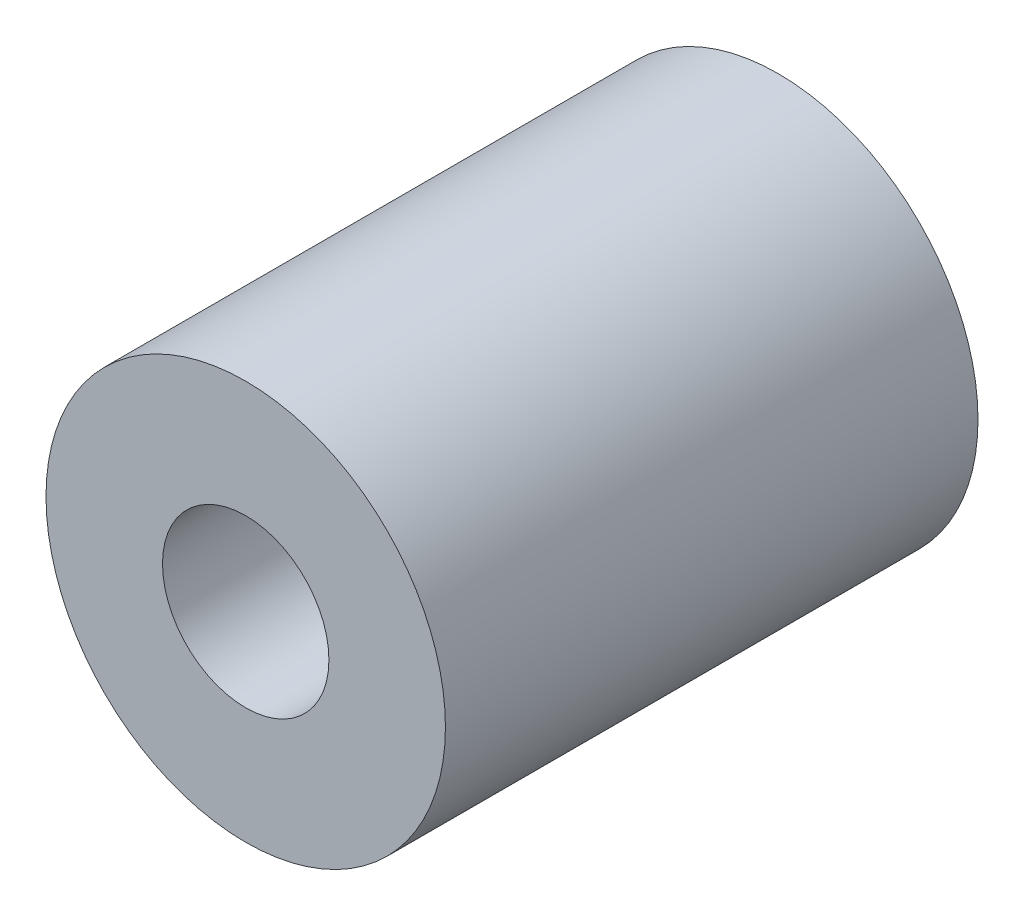
ISO-10303-21;
HEADER;
FILE_DESCRIPTION(('STEP AP214'),'2;1');
FILE_NAME('part.step','',(''),(''),'','','');
FILE_SCHEMA(('AUTOMOTIVE_DESIGN { 1 0 10303 214 1 1 1 1 }'));
ENDSEC;
DATA;
#1=APPLICATION_CONTEXT('core data for automotive mechanical design processes');
#2=APPLICATION_PROTOCOL_DEFINITION('international standard','automotive_design',2000,#1);
#3=PRODUCT_CONTEXT('',#1,'mechanical');
#4=PRODUCT('Part','Part','',(#3));
#5=PRODUCT_RELATED_PRODUCT_CATEGORY('part','',(#4));
#6=PRODUCT_DEFINITION_FORMATION('','',#4);
#7=PRODUCT_DEFINITION_CONTEXT('part definition',#1,'design');
#8=PRODUCT_DEFINITION('design','',#6,#7);
#9=PRODUCT_DEFINITION_SHAPE('','',#8);
#10=(LENGTH_UNIT() NAMED_UNIT(*) SI_UNIT(.MILLI.,.METRE.));
#11=(NAMED_UNIT(*) PLANE_ANGLE_UNIT() SI_UNIT($,.RADIAN.));
#12=(NAMED_UNIT(*) SI_UNIT($,.STERADIAN.) SOLID_ANGLE_UNIT());
#13=UNCERTAINTY_MEASURE_WITH_UNIT(LENGTH_MEASURE(1.E-05),#10,'distance_accuracy_value','');
#14=(GEOMETRIC_REPRESENTATION_CONTEXT(3) GLOBAL_UNCERTAINTY_ASSIGNED_CONTEXT((#13)) GLOBAL_UNIT_ASSIGNED_CONTEXT((#10,
#11,#12)) REPRESENTATION_CONTEXT('',''));
#15=CARTESIAN_POINT('',(0.,0.,0.));
#16=DIRECTION('',(0.,0.,1.));
#17=DIRECTION('',(1.,0.,0.));
#18=AXIS2_PLACEMENT_3D('',#15,#16,#17);
#19=CARTESIAN_POINT('',(0.,0.,-50.8));
#20=DIRECTION('',(0.,0.,1.));
#21=DIRECTION('',(1.,0.,0.));
#22=AXIS2_PLACEMENT_3D('',#19,#20,#21);
#23=CYLINDRICAL_SURFACE('',#22,19.05);
#24=CARTESIAN_POINT('',(0.,0.,-50.8));
#25=DIRECTION('',(0.,0.,1.));
#26=DIRECTION('',(1.,0.,0.));
#27=AXIS2_PLACEMENT_3D('',#24,#25,#26);
#28=CIRCLE('',#27,19.05);
#29=CARTESIAN_POINT('',(19.05,0.,-50.8));
#30=VERTEX_POINT('',#29);
#31=EDGE_CURVE('E10',#30,#30,#28,.T.);
#32=ORIENTED_EDGE('',*,*,#31,.T.);
#33=EDGE_LOOP('',(#32));
#34=FACE_BOUND('',#33,.T.);
#35=CARTESIAN_POINT('',(0.,0.,0.));
#36=DIRECTION('',(0.,0.,1.));
#37=DIRECTION('',(1.,0.,0.));
#38=AXIS2_PLACEMENT_3D('',#35,#36,#37);
#39=CIRCLE('',#38,19.05);
#40=CARTESIAN_POINT('',(19.05,0.,0.));
#41=VERTEX_POINT('',#40);
#42=EDGE_CURVE('E32',#41,#41,#39,.T.);
#43=ORIENTED_EDGE('',*,*,#42,.F.);
#44=EDGE_LOOP('',(#43));
#45=FACE_BOUND('',#44,.T.);
#46=ADVANCED_FACE('F29',(#34,#45),#23,.T.);
#47=CARTESIAN_POINT('',(0.,0.,-50.8));
#48=DIRECTION('',(0.,0.,1.));
#49=DIRECTION('',(1.,0.,0.));
#50=AXIS2_PLACEMENT_3D('',#47,#48,#49);
#51=PLANE('',#50);
#52=CARTESIAN_POINT('',(0.,0.,-50.8));
#53=DIRECTION('',(0.,0.,1.));
#54=DIRECTION('',(1.,0.,0.));
#55=AXIS2_PLACEMENT_3D('',#52,#53,#54);
#56=CIRCLE('',#55,7.9375);
#57=CARTESIAN_POINT('',(7.9375,0.,-50.8));
#58=VERTEX_POINT('',#57);
#59=EDGE_CURVE('E39',#58,#58,#56,.T.);
#60=ORIENTED_EDGE('',*,*,#59,.T.);
#61=EDGE_LOOP('',(#60));
#62=FACE_BOUND('',#61,.T.);
#63=ORIENTED_EDGE('',*,*,#31,.F.);
#64=EDGE_LOOP('',(#63));
#65=FACE_BOUND('',#64,.T.);
#66=ADVANCED_FACE('F53',(#62,#65),#51,.F.);
#67=CARTESIAN_POINT('',(0.,0.,0.));
#68=DIRECTION('',(0.,0.,1.));
#69=DIRECTION('',(1.,0.,0.));
#70=AXIS2_PLACEMENT_3D('',#67,#68,#69);
#71=PLANE('',#70);
#72=CARTESIAN_POINT('',(0.,0.,0.));
#73=DIRECTION('',(0.,0.,1.));
#74=DIRECTION('',(1.,0.,0.));
#75=AXIS2_PLACEMENT_3D('',#72,#73,#74);
#76=CIRCLE('',#75,7.9375);
#77=CARTESIAN_POINT('',(7.9375,0.,0.));
#78=VERTEX_POINT('',#77);
#79=EDGE_CURVE('E43',#78,#78,#76,.T.);
#80=ORIENTED_EDGE('',*,*,#79,.F.);
#81=EDGE_LOOP('',(#80));
#82=FACE_BOUND('',#81,.T.);
#83=ORIENTED_EDGE('',*,*,#42,.T.);
#84=EDGE_LOOP('',(#83));
#85=FACE_BOUND('',#84,.T.);
#86=ADVANCED_FACE('F50',(#82,#85),#71,.T.);
#87=CARTESIAN_POINT('',(0.,0.,-63.5));
#88=DIRECTION('',(0.,0.,1.));
#89=DIRECTION('',(1.,0.,0.));
#90=AXIS2_PLACEMENT_3D('',#87,#88,#89);
#91=CYLINDRICAL_SURFACE('',#90,7.9375);
#92=ORIENTED_EDGE('',*,*,#79,.T.);
#93=EDGE_LOOP('',(#92));
#94=FACE_BOUND('',#93,.T.);
#95=ORIENTED_EDGE('',*,*,#59,.F.);
#96=EDGE_LOOP('',(#95));
#97=FACE_BOUND('',#96,.T.);
#98=ADVANCED_FACE('F47',(#94,#97),#91,.F.);
#99=CLOSED_SHELL('',(#46,#66,#86,#98));
#100=MANIFOLD_SOLID_BREP('B2',#99);
#101=ADVANCED_BREP_SHAPE_REPRESENTATION('',(#18,#100),#14);
#102=SHAPE_DEFINITION_REPRESENTATION(#9,#101);
ENDSEC;
END-ISO-10303-21;
